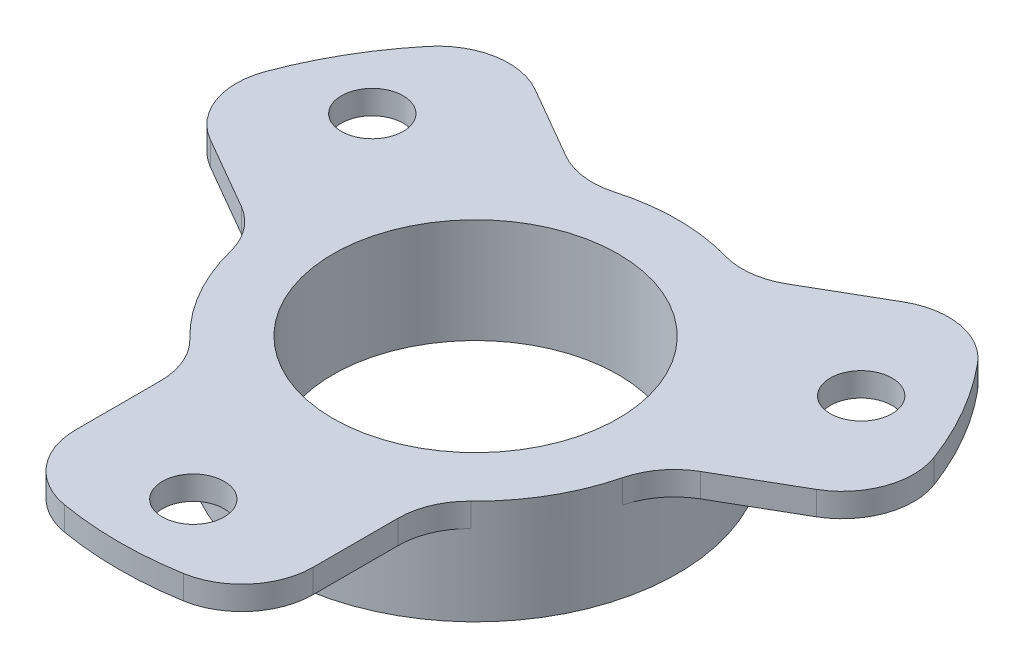
ISO-10303-21;
HEADER;
FILE_DESCRIPTION(('STEP AP214'),'2;1');
FILE_NAME('part.step','',(''),(''),'','','');
FILE_SCHEMA(('AUTOMOTIVE_DESIGN { 1 0 10303 214 1 1 1 1 }'));
ENDSEC;
DATA;
#1=APPLICATION_CONTEXT('core data for automotive mechanical design processes');
#2=APPLICATION_PROTOCOL_DEFINITION('international standard','automotive_design',2000,#1);
#3=PRODUCT_CONTEXT('',#1,'mechanical');
#4=PRODUCT('Part','Part','',(#3));
#5=PRODUCT_RELATED_PRODUCT_CATEGORY('part','',(#4));
#6=PRODUCT_DEFINITION_FORMATION('','',#4);
#7=PRODUCT_DEFINITION_CONTEXT('part definition',#1,'design');
#8=PRODUCT_DEFINITION('design','',#6,#7);
#9=PRODUCT_DEFINITION_SHAPE('','',#8);
#10=(LENGTH_UNIT() NAMED_UNIT(*) SI_UNIT(.MILLI.,.METRE.));
#11=(NAMED_UNIT(*) PLANE_ANGLE_UNIT() SI_UNIT($,.RADIAN.));
#12=(NAMED_UNIT(*) SI_UNIT($,.STERADIAN.) SOLID_ANGLE_UNIT());
#13=UNCERTAINTY_MEASURE_WITH_UNIT(LENGTH_MEASURE(1.E-05),#10,'distance_accuracy_value','');
#14=(GEOMETRIC_REPRESENTATION_CONTEXT(3) GLOBAL_UNCERTAINTY_ASSIGNED_CONTEXT((#13)) GLOBAL_UNIT_ASSIGNED_CONTEXT((#10,
#11,#12)) REPRESENTATION_CONTEXT('',''));
#15=CARTESIAN_POINT('',(0.,0.,0.));
#16=DIRECTION('',(0.,0.,1.));
#17=DIRECTION('',(1.,0.,0.));
#18=AXIS2_PLACEMENT_3D('',#15,#16,#17);
#19=CARTESIAN_POINT('',(-40.,2.,0.));
#20=DIRECTION('',(0.,1.,0.));
#21=DIRECTION('',(0.,0.,1.));
#22=AXIS2_PLACEMENT_3D('',#19,#20,#21);
#23=PLANE('',#22);
#24=CARTESIAN_POINT('',(0.,2.,23.75));
#25=DIRECTION('',(0.,-1.,0.));
#26=DIRECTION('',(0.,0.,-1.));
#27=AXIS2_PLACEMENT_3D('',#24,#25,#26);
#28=CIRCLE('',#27,2.6);
#29=CARTESIAN_POINT('',(0.,2.,21.15));
#30=VERTEX_POINT('',#29);
#31=EDGE_CURVE('E449',#30,#30,#28,.T.);
#32=ORIENTED_EDGE('',*,*,#31,.T.);
#33=EDGE_LOOP('',(#32));
#34=FACE_BOUND('',#33,.T.);
#35=CARTESIAN_POINT('',(0.,2.,0.));
#36=DIRECTION('',(0.,1.,0.));
#37=DIRECTION('',(0.,0.,1.));
#38=AXIS2_PLACEMENT_3D('',#35,#36,#37);
#39=CIRCLE('',#38,30.);
#40=CARTESIAN_POINT('',(-5.,2.,29.5803989154981));
#41=VERTEX_POINT('',#40);
#42=CARTESIAN_POINT('',(4.99999999999999,2.,29.5803989154981));
#43=VERTEX_POINT('',#42);
#44=EDGE_CURVE('E44',#41,#43,#39,.T.);
#45=ORIENTED_EDGE('',*,*,#44,.T.);
#46=CARTESIAN_POINT('',(4.,2.,23.6643191323985));
#47=DIRECTION('',(0.,1.,0.));
#48=DIRECTION('',(0.,0.,1.));
#49=AXIS2_PLACEMENT_3D('',#46,#47,#48);
#50=CIRCLE('',#49,6.);
#51=CARTESIAN_POINT('',(10.,2.,23.6643191323985));
#52=VERTEX_POINT('',#51);
#53=EDGE_CURVE('E12',#43,#52,#50,.T.);
#54=ORIENTED_EDGE('',*,*,#53,.T.);
#55=DIRECTION('',(0.,0.,-1.));
#56=VECTOR('',#55,1.);
#57=CARTESIAN_POINT('',(9.99999999999999,2.,0.));
#58=LINE('',#57,#56);
#59=CARTESIAN_POINT('',(9.99999999999999,2.,16.5227116418583));
#60=VERTEX_POINT('',#59);
#61=EDGE_CURVE('E298',#52,#60,#58,.T.);
#62=ORIENTED_EDGE('',*,*,#61,.T.);
#63=CARTESIAN_POINT('',(16.,2.,16.5227116418583));
#64=DIRECTION('',(0.,1.,0.));
#65=DIRECTION('',(0.,0.,1.));
#66=AXIS2_PLACEMENT_3D('',#63,#64,#65);
#67=CIRCLE('',#66,6.);
#68=CARTESIAN_POINT('',(11.8260869565217,2.,12.2124390396344));
#69=VERTEX_POINT('',#68);
#70=EDGE_CURVE('E207',#60,#69,#67,.F.);
#71=ORIENTED_EDGE('',*,*,#70,.T.);
#72=CARTESIAN_POINT('',(0.,2.,0.));
#73=DIRECTION('',(0.,1.,0.));
#74=DIRECTION('',(0.,0.,1.));
#75=AXIS2_PLACEMENT_3D('',#72,#73,#74);
#76=CIRCLE('',#75,17.);
#77=CARTESIAN_POINT('',(16.4893259287531,2.,4.13547221189442));
#78=VERTEX_POINT('',#77);
#79=EDGE_CURVE('E301',#69,#78,#76,.T.);
#80=ORIENTED_EDGE('',*,*,#79,.T.);
#81=CARTESIAN_POINT('',(22.3090880212542,2.,5.59505063962186));
#82=DIRECTION('',(0.,1.,0.));
#83=DIRECTION('',(0.,0.,1.));
#84=AXIS2_PLACEMENT_3D('',#81,#82,#83);
#85=CIRCLE('',#84,6.);
#86=CARTESIAN_POINT('',(19.3090880212542,2.,0.39889821691523));
#87=VERTEX_POINT('',#86);
#88=EDGE_CURVE('E304',#78,#87,#85,.F.);
#89=ORIENTED_EDGE('',*,*,#88,.T.);
#90=DIRECTION('',(0.866025403784439,0.,-0.5));
#91=VECTOR('',#90,1.);
#92=CARTESIAN_POINT('',(-25.,2.,25.9807621135332));
#93=LINE('',#92,#91);
#94=CARTESIAN_POINT('',(25.4939015319192,2.,-3.17190552835484));
#95=VERTEX_POINT('',#94);
#96=EDGE_CURVE('E307',#87,#95,#93,.T.);
#97=ORIENTED_EDGE('',*,*,#96,.T.);
#98=CARTESIAN_POINT('',(22.4939015319192,2.,-8.36805795106148));
#99=DIRECTION('',(0.,1.,0.));
#100=DIRECTION('',(0.,0.,1.));
#101=AXIS2_PLACEMENT_3D('',#98,#99,#100);
#102=CIRCLE('',#101,6.);
#103=CARTESIAN_POINT('',(28.117376914899,2.,-10.4600724388268));
#104=VERTEX_POINT('',#103);
#105=EDGE_CURVE('E310',#95,#104,#102,.T.);
#106=ORIENTED_EDGE('',*,*,#105,.T.);
#107=CARTESIAN_POINT('',(0.,2.,0.));
#108=DIRECTION('',(0.,1.,0.));
#109=DIRECTION('',(0.,0.,1.));
#110=AXIS2_PLACEMENT_3D('',#107,#108,#109);
#111=CIRCLE('',#110,30.);
#112=CARTESIAN_POINT('',(23.117376914899,2.,-19.1203264766712));
#113=VERTEX_POINT('',#112);
#114=EDGE_CURVE('E313',#104,#113,#111,.T.);
#115=ORIENTED_EDGE('',*,*,#114,.T.);
#116=CARTESIAN_POINT('',(18.4939015319192,2.,-15.296261181337));
#117=DIRECTION('',(0.,1.,0.));
#118=DIRECTION('',(0.,0.,1.));
#119=AXIS2_PLACEMENT_3D('',#116,#117,#118);
#120=CIRCLE('',#119,6.00000000000001);
#121=CARTESIAN_POINT('',(15.4939015319192,2.,-20.4924136040436));
#122=VERTEX_POINT('',#121);
#123=EDGE_CURVE('E316',#113,#122,#120,.T.);
#124=ORIENTED_EDGE('',*,*,#123,.T.);
#125=DIRECTION('',(-0.866025403784439,0.,0.5));
#126=VECTOR('',#125,1.);
#127=CARTESIAN_POINT('',(-35.,2.,8.66025403784439));
#128=LINE('',#127,#126);
#129=CARTESIAN_POINT('',(9.30908802125418,2.,-16.9216098587735));
#130=VERTEX_POINT('',#129);
#131=EDGE_CURVE('E319',#122,#130,#128,.T.);
#132=ORIENTED_EDGE('',*,*,#131,.T.);
#133=CARTESIAN_POINT('',(6.30908802125418,2.,-22.1177622814802));
#134=DIRECTION('',(0.,1.,0.));
#135=DIRECTION('',(0.,0.,1.));
#136=AXIS2_PLACEMENT_3D('',#133,#134,#135);
#137=CIRCLE('',#136,6.);
#138=CARTESIAN_POINT('',(4.66323897223135,2.,-16.3479112515288));
#139=VERTEX_POINT('',#138);
#140=EDGE_CURVE('E322',#130,#139,#137,.F.);
#141=ORIENTED_EDGE('',*,*,#140,.T.);
#142=CARTESIAN_POINT('',(0.,2.,0.));
#143=DIRECTION('',(0.,1.,0.));
#144=DIRECTION('',(0.,0.,1.));
#145=AXIS2_PLACEMENT_3D('',#142,#143,#144);
#146=CIRCLE('',#145,17.);
#147=CARTESIAN_POINT('',(-4.66323897223135,2.,-16.3479112515288));
#148=VERTEX_POINT('',#147);
#149=EDGE_CURVE('E325',#139,#148,#146,.T.);
#150=ORIENTED_EDGE('',*,*,#149,.T.);
#151=CARTESIAN_POINT('',(-6.30908802125418,2.,-22.1177622814802));
#152=DIRECTION('',(0.,1.,0.));
#153=DIRECTION('',(0.,0.,1.));
#154=AXIS2_PLACEMENT_3D('',#151,#152,#153);
#155=CIRCLE('',#154,6.);
#156=CARTESIAN_POINT('',(-9.30908802125419,2.,-16.9216098587735));
#157=VERTEX_POINT('',#156);
#158=EDGE_CURVE('E328',#148,#157,#155,.F.);
#159=ORIENTED_EDGE('',*,*,#158,.T.);
#160=DIRECTION('',(-0.866025403784439,0.,-0.5));
#161=VECTOR('',#160,1.);
#162=CARTESIAN_POINT('',(-25.,2.,-25.9807621135332));
#163=LINE('',#162,#161);
#164=CARTESIAN_POINT('',(-15.4939015319192,2.,-20.4924136040436));
#165=VERTEX_POINT('',#164);
#166=EDGE_CURVE('E331',#157,#165,#163,.T.);
#167=ORIENTED_EDGE('',*,*,#166,.T.);
#168=CARTESIAN_POINT('',(-18.4939015319192,2.,-15.296261181337));
#169=DIRECTION('',(0.,1.,0.));
#170=DIRECTION('',(0.,0.,1.));
#171=AXIS2_PLACEMENT_3D('',#168,#169,#170);
#172=CIRCLE('',#171,6.);
#173=CARTESIAN_POINT('',(-23.117376914899,2.,-19.1203264766712));
#174=VERTEX_POINT('',#173);
#175=EDGE_CURVE('E334',#165,#174,#172,.T.);
#176=ORIENTED_EDGE('',*,*,#175,.T.);
#177=CARTESIAN_POINT('',(0.,2.,0.));
#178=DIRECTION('',(0.,1.,0.));
#179=DIRECTION('',(0.,0.,1.));
#180=AXIS2_PLACEMENT_3D('',#177,#178,#179);
#181=CIRCLE('',#180,30.);
#182=CARTESIAN_POINT('',(-28.117376914899,2.,-10.4600724388268));
#183=VERTEX_POINT('',#182);
#184=EDGE_CURVE('E337',#174,#183,#181,.T.);
#185=ORIENTED_EDGE('',*,*,#184,.T.);
#186=CARTESIAN_POINT('',(-22.4939015319192,2.,-8.36805795106148));
#187=DIRECTION('',(0.,1.,0.));
#188=DIRECTION('',(0.,0.,1.));
#189=AXIS2_PLACEMENT_3D('',#186,#187,#188);
#190=CIRCLE('',#189,6.);
#191=CARTESIAN_POINT('',(-25.4939015319192,2.,-3.17190552835484));
#192=VERTEX_POINT('',#191);
#193=EDGE_CURVE('E340',#183,#192,#190,.T.);
#194=ORIENTED_EDGE('',*,*,#193,.T.);
#195=DIRECTION('',(0.866025403784439,0.,0.5));
#196=VECTOR('',#195,1.);
#197=CARTESIAN_POINT('',(-35.,2.,-8.66025403784439));
#198=LINE('',#197,#196);
#199=CARTESIAN_POINT('',(-19.3090880212542,2.,0.398898216915236));
#200=VERTEX_POINT('',#199);
#201=EDGE_CURVE('E343',#192,#200,#198,.T.);
#202=ORIENTED_EDGE('',*,*,#201,.T.);
#203=CARTESIAN_POINT('',(-22.3090880212542,2.,5.59505063962187));
#204=DIRECTION('',(0.,1.,0.));
#205=DIRECTION('',(0.,0.,1.));
#206=AXIS2_PLACEMENT_3D('',#203,#204,#205);
#207=CIRCLE('',#206,6.);
#208=CARTESIAN_POINT('',(-16.4893259287531,2.,4.13547221189442));
#209=VERTEX_POINT('',#208);
#210=EDGE_CURVE('E346',#200,#209,#207,.F.);
#211=ORIENTED_EDGE('',*,*,#210,.T.);
#212=CARTESIAN_POINT('',(0.,2.,0.));
#213=DIRECTION('',(0.,1.,0.));
#214=DIRECTION('',(0.,0.,1.));
#215=AXIS2_PLACEMENT_3D('',#212,#213,#214);
#216=CIRCLE('',#215,17.);
#217=CARTESIAN_POINT('',(-11.8260869565217,2.,12.2124390396344));
#218=VERTEX_POINT('',#217);
#219=EDGE_CURVE('E349',#209,#218,#216,.T.);
#220=ORIENTED_EDGE('',*,*,#219,.T.);
#221=CARTESIAN_POINT('',(-16.,2.,16.5227116418583));
#222=DIRECTION('',(0.,1.,0.));
#223=DIRECTION('',(0.,0.,1.));
#224=AXIS2_PLACEMENT_3D('',#221,#222,#223);
#225=CIRCLE('',#224,6.);
#226=CARTESIAN_POINT('',(-9.99999999999999,2.,16.5227116418583));
#227=VERTEX_POINT('',#226);
#228=EDGE_CURVE('E352',#218,#227,#225,.F.);
#229=ORIENTED_EDGE('',*,*,#228,.T.);
#230=DIRECTION('',(0.,0.,1.));
#231=VECTOR('',#230,1.);
#232=CARTESIAN_POINT('',(-9.99999999999999,2.,0.));
#233=LINE('',#232,#231);
#234=CARTESIAN_POINT('',(-10.,2.,23.6643191323985));
#235=VERTEX_POINT('',#234);
#236=EDGE_CURVE('E355',#227,#235,#233,.T.);
#237=ORIENTED_EDGE('',*,*,#236,.T.);
#238=CARTESIAN_POINT('',(-4.,2.,23.6643191323985));
#239=DIRECTION('',(0.,1.,0.));
#240=DIRECTION('',(0.,0.,1.));
#241=AXIS2_PLACEMENT_3D('',#238,#239,#240);
#242=CIRCLE('',#241,6.);
#243=EDGE_CURVE('E358',#235,#41,#242,.T.);
#244=ORIENTED_EDGE('',*,*,#243,.T.);
#245=EDGE_LOOP('',(#45,#54,#62,#71,#80,#89,#97,#106,#115,#124,#132,#141,#150,#159,#167,#176,
#185,#194,#202,#211,#220,#229,#237,#244));
#246=FACE_BOUND('',#245,.T.);
#247=CARTESIAN_POINT('',(0.,2.,0.));
#248=DIRECTION('',(0.,1.,0.));
#249=DIRECTION('',(0.,0.,1.));
#250=AXIS2_PLACEMENT_3D('',#247,#248,#249);
#251=CIRCLE('',#250,12.);
#252=CARTESIAN_POINT('',(0.,2.,12.));
#253=VERTEX_POINT('',#252);
#254=EDGE_CURVE('E274',#253,#253,#251,.T.);
#255=ORIENTED_EDGE('',*,*,#254,.F.);
#256=EDGE_LOOP('',(#255));
#257=FACE_BOUND('',#256,.T.);
#258=CARTESIAN_POINT('',(20.5681033398804,2.,-11.875));
#259=DIRECTION('',(0.,-1.,0.));
#260=DIRECTION('',(0.,0.,-1.));
#261=AXIS2_PLACEMENT_3D('',#258,#259,#260);
#262=CIRCLE('',#261,2.6);
#263=CARTESIAN_POINT('',(20.5681033398804,2.,-14.475));
#264=VERTEX_POINT('',#263);
#265=EDGE_CURVE('E434',#264,#264,#262,.T.);
#266=ORIENTED_EDGE('',*,*,#265,.T.);
#267=EDGE_LOOP('',(#266));
#268=FACE_BOUND('',#267,.T.);
#269=CARTESIAN_POINT('',(-20.5681033398805,2.,-11.8749999999999));
#270=DIRECTION('',(0.,-1.,0.));
#271=DIRECTION('',(0.,0.,-1.));
#272=AXIS2_PLACEMENT_3D('',#269,#270,#271);
#273=CIRCLE('',#272,2.6);
#274=CARTESIAN_POINT('',(-20.5681033398805,2.,-14.4749999999999));
#275=VERTEX_POINT('',#274);
#276=EDGE_CURVE('E441',#275,#275,#273,.T.);
#277=ORIENTED_EDGE('',*,*,#276,.T.);
#278=EDGE_LOOP('',(#277));
#279=FACE_BOUND('',#278,.T.);
#280=ADVANCED_FACE('F36',(#34,#246,#257,#268,#279),#23,.T.);
#281=CARTESIAN_POINT('',(-40.,0.,0.));
#282=DIRECTION('',(0.,-1.,0.));
#283=DIRECTION('',(0.,0.,-1.));
#284=AXIS2_PLACEMENT_3D('',#281,#282,#283);
#285=PLANE('',#284);
#286=CARTESIAN_POINT('',(-20.5681033398805,0.,-11.8749999999999));
#287=DIRECTION('',(0.,-1.,0.));
#288=DIRECTION('',(0.,0.,-1.));
#289=AXIS2_PLACEMENT_3D('',#286,#287,#288);
#290=CIRCLE('',#289,2.6);
#291=CARTESIAN_POINT('',(-20.5681033398805,0.,-14.4749999999999));
#292=VERTEX_POINT('',#291);
#293=EDGE_CURVE('E446',#292,#292,#290,.T.);
#294=ORIENTED_EDGE('',*,*,#293,.F.);
#295=EDGE_LOOP('',(#294));
#296=FACE_BOUND('',#295,.T.);
#297=CARTESIAN_POINT('',(0.,0.,0.));
#298=DIRECTION('',(0.,1.,0.));
#299=DIRECTION('',(0.,0.,1.));
#300=AXIS2_PLACEMENT_3D('',#297,#298,#299);
#301=CIRCLE('',#300,17.);
#302=CARTESIAN_POINT('',(-4.66323897223135,0.,-16.3479112515288));
#303=VERTEX_POINT('',#302);
#304=CARTESIAN_POINT('',(-16.4893259287531,0.,4.13547221189442));
#305=VERTEX_POINT('',#304);
#306=EDGE_CURVE('E296',#303,#305,#301,.T.);
#307=ORIENTED_EDGE('',*,*,#306,.T.);
#308=CARTESIAN_POINT('',(-22.3090880212542,0.,5.59505063962187));
#309=DIRECTION('',(0.,-1.,0.));
#310=DIRECTION('',(0.,0.,-1.));
#311=AXIS2_PLACEMENT_3D('',#308,#309,#310);
#312=CIRCLE('',#311,6.);
#313=CARTESIAN_POINT('',(-19.3090880212542,0.,0.398898216915236));
#314=VERTEX_POINT('',#313);
#315=EDGE_CURVE('E259',#305,#314,#312,.F.);
#316=ORIENTED_EDGE('',*,*,#315,.T.);
#317=DIRECTION('',(-0.866025403784439,0.,-0.5));
#318=VECTOR('',#317,1.);
#319=CARTESIAN_POINT('',(-35.,0.,-8.66025403784439));
#320=LINE('',#319,#318);
#321=CARTESIAN_POINT('',(-25.4939015319192,0.,-3.17190552835484));
#322=VERTEX_POINT('',#321);
#323=EDGE_CURVE('E256',#314,#322,#320,.T.);
#324=ORIENTED_EDGE('',*,*,#323,.T.);
#325=CARTESIAN_POINT('',(-22.4939015319192,0.,-8.36805795106148));
#326=DIRECTION('',(0.,-1.,0.));
#327=DIRECTION('',(0.,0.,-1.));
#328=AXIS2_PLACEMENT_3D('',#325,#326,#327);
#329=CIRCLE('',#328,6.);
#330=CARTESIAN_POINT('',(-28.117376914899,0.,-10.4600724388268));
#331=VERTEX_POINT('',#330);
#332=EDGE_CURVE('E253',#322,#331,#329,.T.);
#333=ORIENTED_EDGE('',*,*,#332,.T.);
#334=CARTESIAN_POINT('',(0.,0.,0.));
#335=DIRECTION('',(0.,-1.,0.));
#336=DIRECTION('',(0.,0.,-1.));
#337=AXIS2_PLACEMENT_3D('',#334,#335,#336);
#338=CIRCLE('',#337,30.);
#339=CARTESIAN_POINT('',(-23.117376914899,0.,-19.1203264766712));
#340=VERTEX_POINT('',#339);
#341=EDGE_CURVE('E250',#331,#340,#338,.T.);
#342=ORIENTED_EDGE('',*,*,#341,.T.);
#343=CARTESIAN_POINT('',(-18.4939015319192,0.,-15.296261181337));
#344=DIRECTION('',(0.,-1.,0.));
#345=DIRECTION('',(0.,0.,-1.));
#346=AXIS2_PLACEMENT_3D('',#343,#344,#345);
#347=CIRCLE('',#346,6.);
#348=CARTESIAN_POINT('',(-15.4939015319192,0.,-20.4924136040436));
#349=VERTEX_POINT('',#348);
#350=EDGE_CURVE('E247',#340,#349,#347,.T.);
#351=ORIENTED_EDGE('',*,*,#350,.T.);
#352=DIRECTION('',(0.866025403784439,0.,0.5));
#353=VECTOR('',#352,1.);
#354=CARTESIAN_POINT('',(-25.,0.,-25.9807621135332));
#355=LINE('',#354,#353);
#356=CARTESIAN_POINT('',(-9.30908802125419,0.,-16.9216098587735));
#357=VERTEX_POINT('',#356);
#358=EDGE_CURVE('E244',#349,#357,#355,.T.);
#359=ORIENTED_EDGE('',*,*,#358,.T.);
#360=CARTESIAN_POINT('',(-6.30908802125418,0.,-22.1177622814802));
#361=DIRECTION('',(0.,-1.,0.));
#362=DIRECTION('',(0.,0.,-1.));
#363=AXIS2_PLACEMENT_3D('',#360,#361,#362);
#364=CIRCLE('',#363,6.);
#365=EDGE_CURVE('E241',#357,#303,#364,.F.);
#366=ORIENTED_EDGE('',*,*,#365,.T.);
#367=EDGE_LOOP('',(#307,#316,#324,#333,#342,#351,#359,#366));
#368=FACE_BOUND('',#367,.T.);
#369=ADVANCED_FACE('F38',(#296,#368),#285,.T.);
#370=CARTESIAN_POINT('',(20.5681033398804,0.,-11.875));
#371=DIRECTION('',(0.,-1.,0.));
#372=DIRECTION('',(0.,0.,-1.));
#373=AXIS2_PLACEMENT_3D('',#370,#371,#372);
#374=CIRCLE('',#373,2.6);
#375=CARTESIAN_POINT('',(20.5681033398804,0.,-14.475));
#376=VERTEX_POINT('',#375);
#377=EDGE_CURVE('E437',#376,#376,#374,.T.);
#378=ORIENTED_EDGE('',*,*,#377,.F.);
#379=EDGE_LOOP('',(#378));
#380=FACE_BOUND('',#379,.T.);
#381=CARTESIAN_POINT('',(16.4893259287531,0.,4.13547221189442));
#382=VERTEX_POINT('',#381);
#383=CARTESIAN_POINT('',(4.66323897223135,0.,-16.3479112515288));
#384=VERTEX_POINT('',#383);
#385=EDGE_CURVE('E297',#382,#384,#301,.T.);
#386=ORIENTED_EDGE('',*,*,#385,.T.);
#387=CARTESIAN_POINT('',(6.30908802125418,0.,-22.1177622814802));
#388=DIRECTION('',(0.,-1.,0.));
#389=DIRECTION('',(0.,0.,-1.));
#390=AXIS2_PLACEMENT_3D('',#387,#388,#389);
#391=CIRCLE('',#390,6.);
#392=CARTESIAN_POINT('',(9.30908802125418,0.,-16.9216098587735));
#393=VERTEX_POINT('',#392);
#394=EDGE_CURVE('E238',#384,#393,#391,.F.);
#395=ORIENTED_EDGE('',*,*,#394,.T.);
#396=DIRECTION('',(0.866025403784439,0.,-0.5));
#397=VECTOR('',#396,1.);
#398=CARTESIAN_POINT('',(-35.,0.,8.66025403784439));
#399=LINE('',#398,#397);
#400=CARTESIAN_POINT('',(15.4939015319192,0.,-20.4924136040436));
#401=VERTEX_POINT('',#400);
#402=EDGE_CURVE('E235',#393,#401,#399,.T.);
#403=ORIENTED_EDGE('',*,*,#402,.T.);
#404=CARTESIAN_POINT('',(18.4939015319192,0.,-15.296261181337));
#405=DIRECTION('',(0.,-1.,0.));
#406=DIRECTION('',(0.,0.,-1.));
#407=AXIS2_PLACEMENT_3D('',#404,#405,#406);
#408=CIRCLE('',#407,6.00000000000001);
#409=CARTESIAN_POINT('',(23.117376914899,0.,-19.1203264766712));
#410=VERTEX_POINT('',#409);
#411=EDGE_CURVE('E232',#401,#410,#408,.T.);
#412=ORIENTED_EDGE('',*,*,#411,.T.);
#413=CARTESIAN_POINT('',(0.,0.,0.));
#414=DIRECTION('',(0.,-1.,0.));
#415=DIRECTION('',(0.,0.,-1.));
#416=AXIS2_PLACEMENT_3D('',#413,#414,#415);
#417=CIRCLE('',#416,30.);
#418=CARTESIAN_POINT('',(28.117376914899,0.,-10.4600724388268));
#419=VERTEX_POINT('',#418);
#420=EDGE_CURVE('E229',#410,#419,#417,.T.);
#421=ORIENTED_EDGE('',*,*,#420,.T.);
#422=CARTESIAN_POINT('',(22.4939015319192,0.,-8.36805795106148));
#423=DIRECTION('',(0.,-1.,0.));
#424=DIRECTION('',(0.,0.,-1.));
#425=AXIS2_PLACEMENT_3D('',#422,#423,#424);
#426=CIRCLE('',#425,6.);
#427=CARTESIAN_POINT('',(25.4939015319192,0.,-3.17190552835484));
#428=VERTEX_POINT('',#427);
#429=EDGE_CURVE('E226',#419,#428,#426,.T.);
#430=ORIENTED_EDGE('',*,*,#429,.T.);
#431=DIRECTION('',(-0.866025403784439,0.,0.5));
#432=VECTOR('',#431,1.);
#433=CARTESIAN_POINT('',(-25.,0.,25.9807621135332));
#434=LINE('',#433,#432);
#435=CARTESIAN_POINT('',(19.3090880212542,0.,0.39889821691523));
#436=VERTEX_POINT('',#435);
#437=EDGE_CURVE('E220',#428,#436,#434,.T.);
#438=ORIENTED_EDGE('',*,*,#437,.T.);
#439=CARTESIAN_POINT('',(22.3090880212542,0.,5.59505063962186));
#440=DIRECTION('',(0.,-1.,0.));
#441=DIRECTION('',(0.,0.,-1.));
#442=AXIS2_PLACEMENT_3D('',#439,#440,#441);
#443=CIRCLE('',#442,6.);
#444=EDGE_CURVE('E217',#436,#382,#443,.F.);
#445=ORIENTED_EDGE('',*,*,#444,.T.);
#446=EDGE_LOOP('',(#386,#395,#403,#412,#421,#430,#438,#445));
#447=FACE_BOUND('',#446,.T.);
#448=ADVANCED_FACE('F460',(#380,#447),#285,.T.);
#449=CARTESIAN_POINT('',(0.,0.,23.75));
#450=DIRECTION('',(0.,-1.,0.));
#451=DIRECTION('',(0.,0.,-1.));
#452=AXIS2_PLACEMENT_3D('',#449,#450,#451);
#453=CIRCLE('',#452,2.6);
#454=CARTESIAN_POINT('',(0.,0.,21.15));
#455=VERTEX_POINT('',#454);
#456=EDGE_CURVE('E452',#455,#455,#453,.T.);
#457=ORIENTED_EDGE('',*,*,#456,.F.);
#458=EDGE_LOOP('',(#457));
#459=FACE_BOUND('',#458,.T.);
#460=DIRECTION('',(0.,0.,-1.));
#461=VECTOR('',#460,1.);
#462=CARTESIAN_POINT('',(-9.99999999999999,0.,0.));
#463=LINE('',#462,#461);
#464=CARTESIAN_POINT('',(-10.,0.,23.6643191323985));
#465=VERTEX_POINT('',#464);
#466=CARTESIAN_POINT('',(-9.99999999999999,0.,16.5227116418583));
#467=VERTEX_POINT('',#466);
#468=EDGE_CURVE('E264',#465,#467,#463,.T.);
#469=ORIENTED_EDGE('',*,*,#468,.T.);
#470=CARTESIAN_POINT('',(-16.,0.,16.5227116418583));
#471=DIRECTION('',(0.,-1.,0.));
#472=DIRECTION('',(0.,0.,-1.));
#473=AXIS2_PLACEMENT_3D('',#470,#471,#472);
#474=CIRCLE('',#473,6.);
#475=CARTESIAN_POINT('',(-11.8260869565217,0.,12.2124390396344));
#476=VERTEX_POINT('',#475);
#477=EDGE_CURVE('E262',#467,#476,#474,.F.);
#478=ORIENTED_EDGE('',*,*,#477,.T.);
#479=CARTESIAN_POINT('',(11.8260869565217,0.,12.2124390396344));
#480=VERTEX_POINT('',#479);
#481=EDGE_CURVE('E216',#476,#480,#301,.T.);
#482=ORIENTED_EDGE('',*,*,#481,.T.);
#483=CARTESIAN_POINT('',(16.,0.,16.5227116418583));
#484=DIRECTION('',(0.,-1.,0.));
#485=DIRECTION('',(0.,0.,-1.));
#486=AXIS2_PLACEMENT_3D('',#483,#484,#485);
#487=CIRCLE('',#486,6.);
#488=CARTESIAN_POINT('',(10.,0.,16.5227116418583));
#489=VERTEX_POINT('',#488);
#490=EDGE_CURVE('E199',#480,#489,#487,.F.);
#491=ORIENTED_EDGE('',*,*,#490,.T.);
#492=DIRECTION('',(0.,0.,1.));
#493=VECTOR('',#492,1.);
#494=CARTESIAN_POINT('',(9.99999999999999,0.,0.));
#495=LINE('',#494,#493);
#496=CARTESIAN_POINT('',(9.99999999999999,0.,23.6643191323985));
#497=VERTEX_POINT('',#496);
#498=EDGE_CURVE('E194',#489,#497,#495,.T.);
#499=ORIENTED_EDGE('',*,*,#498,.T.);
#500=CARTESIAN_POINT('',(4.,0.,23.6643191323985));
#501=DIRECTION('',(0.,-1.,0.));
#502=DIRECTION('',(0.,0.,-1.));
#503=AXIS2_PLACEMENT_3D('',#500,#501,#502);
#504=CIRCLE('',#503,6.);
#505=CARTESIAN_POINT('',(4.99999999999999,0.,29.5803989154981));
#506=VERTEX_POINT('',#505);
#507=EDGE_CURVE('E272',#497,#506,#504,.T.);
#508=ORIENTED_EDGE('',*,*,#507,.T.);
#509=CARTESIAN_POINT('',(0.,0.,0.));
#510=DIRECTION('',(0.,-1.,0.));
#511=DIRECTION('',(0.,0.,-1.));
#512=AXIS2_PLACEMENT_3D('',#509,#510,#511);
#513=CIRCLE('',#512,30.);
#514=CARTESIAN_POINT('',(-5.,0.,29.5803989154981));
#515=VERTEX_POINT('',#514);
#516=EDGE_CURVE('E269',#506,#515,#513,.T.);
#517=ORIENTED_EDGE('',*,*,#516,.T.);
#518=CARTESIAN_POINT('',(-4.,0.,23.6643191323985));
#519=DIRECTION('',(0.,-1.,0.));
#520=DIRECTION('',(0.,0.,-1.));
#521=AXIS2_PLACEMENT_3D('',#518,#519,#520);
#522=CIRCLE('',#521,6.);
#523=EDGE_CURVE('E266',#515,#465,#522,.T.);
#524=ORIENTED_EDGE('',*,*,#523,.T.);
#525=EDGE_LOOP('',(#469,#478,#482,#491,#499,#508,#517,#524));
#526=FACE_BOUND('',#525,.T.);
#527=ADVANCED_FACE('F213',(#459,#526),#285,.T.);
#528=CARTESIAN_POINT('',(0.,30.0771468736568,0.));
#529=DIRECTION('',(0.,1.,0.));
#530=DIRECTION('',(0.,0.,1.));
#531=AXIS2_PLACEMENT_3D('',#528,#529,#530);
#532=CYLINDRICAL_SURFACE('',#531,17.);
#533=ORIENTED_EDGE('',*,*,#481,.F.);
#534=DIRECTION('',(0.,1.,0.));
#535=VECTOR('',#534,1.);
#536=CARTESIAN_POINT('',(-11.8260869565217,-15.,12.2124390396344));
#537=LINE('',#536,#535);
#538=EDGE_CURVE('E383',#476,#218,#537,.T.);
#539=ORIENTED_EDGE('',*,*,#538,.T.);
#540=ORIENTED_EDGE('',*,*,#219,.F.);
#541=DIRECTION('',(0.,1.,0.));
#542=VECTOR('',#541,1.);
#543=CARTESIAN_POINT('',(-16.4893259287531,-15.,4.13547221189442));
#544=LINE('',#543,#542);
#545=EDGE_CURVE('E386',#305,#209,#544,.T.);
#546=ORIENTED_EDGE('',*,*,#545,.F.);
#547=ORIENTED_EDGE('',*,*,#306,.F.);
#548=DIRECTION('',(0.,1.,0.));
#549=VECTOR('',#548,1.);
#550=CARTESIAN_POINT('',(-4.66323897223135,-15.,-16.3479112515288));
#551=LINE('',#550,#549);
#552=EDGE_CURVE('E407',#303,#148,#551,.T.);
#553=ORIENTED_EDGE('',*,*,#552,.T.);
#554=ORIENTED_EDGE('',*,*,#149,.F.);
#555=DIRECTION('',(0.,1.,0.));
#556=VECTOR('',#555,1.);
#557=CARTESIAN_POINT('',(4.66323897223135,-15.,-16.3479112515288));
#558=LINE('',#557,#556);
#559=EDGE_CURVE('E410',#384,#139,#558,.T.);
#560=ORIENTED_EDGE('',*,*,#559,.F.);
#561=ORIENTED_EDGE('',*,*,#385,.F.);
#562=DIRECTION('',(0.,1.,0.));
#563=VECTOR('',#562,1.);
#564=CARTESIAN_POINT('',(16.4893259287531,-15.,4.13547221189442));
#565=LINE('',#564,#563);
#566=EDGE_CURVE('E431',#382,#78,#565,.T.);
#567=ORIENTED_EDGE('',*,*,#566,.T.);
#568=ORIENTED_EDGE('',*,*,#79,.F.);
#569=DIRECTION('',(0.,1.,0.));
#570=VECTOR('',#569,1.);
#571=CARTESIAN_POINT('',(11.8260869565217,-15.,12.2124390396344));
#572=LINE('',#571,#570);
#573=EDGE_CURVE('E209',#480,#69,#572,.T.);
#574=ORIENTED_EDGE('',*,*,#573,.F.);
#575=EDGE_LOOP('',(#533,#539,#540,#546,#547,#553,#554,#560,#561,#567,#568,#574));
#576=FACE_BOUND('',#575,.T.);
#577=CARTESIAN_POINT('',(0.,-6.8,0.));
#578=DIRECTION('',(0.,1.,0.));
#579=DIRECTION('',(0.,0.,1.));
#580=AXIS2_PLACEMENT_3D('',#577,#578,#579);
#581=CIRCLE('',#580,17.);
#582=CARTESIAN_POINT('',(0.,-6.8,17.));
#583=VERTEX_POINT('',#582);
#584=EDGE_CURVE('E292',#583,#583,#581,.T.);
#585=ORIENTED_EDGE('',*,*,#584,.T.);
#586=EDGE_LOOP('',(#585));
#587=FACE_BOUND('',#586,.T.);
#588=ADVANCED_FACE('F459',(#576,#587),#532,.T.);
#589=CARTESIAN_POINT('',(-15.5,-6.8,0.));
#590=DIRECTION('',(0.,-1.,0.));
#591=DIRECTION('',(0.,0.,-1.));
#592=AXIS2_PLACEMENT_3D('',#589,#590,#591);
#593=PLANE('',#592);
#594=CARTESIAN_POINT('',(0.,-6.8,0.));
#595=DIRECTION('',(0.,1.,0.));
#596=DIRECTION('',(0.,0.,1.));
#597=AXIS2_PLACEMENT_3D('',#594,#595,#596);
#598=CIRCLE('',#597,15.5);
#599=CARTESIAN_POINT('',(0.,-6.8,15.5));
#600=VERTEX_POINT('',#599);
#601=EDGE_CURVE('E289',#600,#600,#598,.T.);
#602=ORIENTED_EDGE('',*,*,#601,.T.);
#603=EDGE_LOOP('',(#602));
#604=FACE_BOUND('',#603,.T.);
#605=ORIENTED_EDGE('',*,*,#584,.F.);
#606=EDGE_LOOP('',(#605));
#607=FACE_BOUND('',#606,.T.);
#608=ADVANCED_FACE('F465',(#604,#607),#593,.T.);
#609=CARTESIAN_POINT('',(0.,30.0771468736568,0.));
#610=DIRECTION('',(0.,1.,0.));
#611=DIRECTION('',(0.,0.,1.));
#612=AXIS2_PLACEMENT_3D('',#609,#610,#611);
#613=CYLINDRICAL_SURFACE('',#612,15.5);
#614=CARTESIAN_POINT('',(0.,0.,0.));
#615=DIRECTION('',(0.,1.,0.));
#616=DIRECTION('',(0.,0.,1.));
#617=AXIS2_PLACEMENT_3D('',#614,#615,#616);
#618=CIRCLE('',#617,15.5);
#619=CARTESIAN_POINT('',(0.,0.,15.5));
#620=VERTEX_POINT('',#619);
#621=EDGE_CURVE('E286',#620,#620,#618,.T.);
#622=ORIENTED_EDGE('',*,*,#621,.T.);
#623=EDGE_LOOP('',(#622));
#624=FACE_BOUND('',#623,.T.);
#625=ORIENTED_EDGE('',*,*,#601,.F.);
#626=EDGE_LOOP('',(#625));
#627=FACE_BOUND('',#626,.T.);
#628=ADVANCED_FACE('F494',(#624,#627),#613,.F.);
#629=CARTESIAN_POINT('',(-15.5,0.,0.));
#630=DIRECTION('',(0.,-1.,0.));
#631=DIRECTION('',(0.,0.,-1.));
#632=AXIS2_PLACEMENT_3D('',#629,#630,#631);
#633=PLANE('',#632);
#634=CARTESIAN_POINT('',(0.,0.,0.));
#635=DIRECTION('',(0.,1.,0.));
#636=DIRECTION('',(0.,0.,1.));
#637=AXIS2_PLACEMENT_3D('',#634,#635,#636);
#638=CIRCLE('',#637,13.5);
#639=CARTESIAN_POINT('',(0.,0.,13.5));
#640=VERTEX_POINT('',#639);
#641=EDGE_CURVE('E283',#640,#640,#638,.T.);
#642=ORIENTED_EDGE('',*,*,#641,.T.);
#643=EDGE_LOOP('',(#642));
#644=FACE_BOUND('',#643,.T.);
#645=ORIENTED_EDGE('',*,*,#621,.F.);
#646=EDGE_LOOP('',(#645));
#647=FACE_BOUND('',#646,.T.);
#648=ADVANCED_FACE('F490',(#644,#647),#633,.T.);
#649=CARTESIAN_POINT('',(0.,30.0771468736568,0.));
#650=DIRECTION('',(0.,1.,0.));
#651=DIRECTION('',(0.,0.,1.));
#652=AXIS2_PLACEMENT_3D('',#649,#650,#651);
#653=CYLINDRICAL_SURFACE('',#652,13.5);
#654=CARTESIAN_POINT('',(0.,-6.8,0.));
#655=DIRECTION('',(0.,1.,0.));
#656=DIRECTION('',(0.,0.,1.));
#657=AXIS2_PLACEMENT_3D('',#654,#655,#656);
#658=CIRCLE('',#657,13.5);
#659=CARTESIAN_POINT('',(0.,-6.8,13.5));
#660=VERTEX_POINT('',#659);
#661=EDGE_CURVE('E280',#660,#660,#658,.T.);
#662=ORIENTED_EDGE('',*,*,#661,.T.);
#663=EDGE_LOOP('',(#662));
#664=FACE_BOUND('',#663,.T.);
#665=ORIENTED_EDGE('',*,*,#641,.F.);
#666=EDGE_LOOP('',(#665));
#667=FACE_BOUND('',#666,.T.);
#668=ADVANCED_FACE('F486',(#664,#667),#653,.T.);
#669=CARTESIAN_POINT('',(-12.,-6.8,0.));
#670=DIRECTION('',(0.,-1.,0.));
#671=DIRECTION('',(0.,0.,-1.));
#672=AXIS2_PLACEMENT_3D('',#669,#670,#671);
#673=PLANE('',#672);
#674=CARTESIAN_POINT('',(0.,-6.8,0.));
#675=DIRECTION('',(0.,1.,0.));
#676=DIRECTION('',(0.,0.,1.));
#677=AXIS2_PLACEMENT_3D('',#674,#675,#676);
#678=CIRCLE('',#677,12.);
#679=CARTESIAN_POINT('',(0.,-6.8,12.));
#680=VERTEX_POINT('',#679);
#681=EDGE_CURVE('E277',#680,#680,#678,.T.);
#682=ORIENTED_EDGE('',*,*,#681,.T.);
#683=EDGE_LOOP('',(#682));
#684=FACE_BOUND('',#683,.T.);
#685=ORIENTED_EDGE('',*,*,#661,.F.);
#686=EDGE_LOOP('',(#685));
#687=FACE_BOUND('',#686,.T.);
#688=ADVANCED_FACE('F482',(#684,#687),#673,.T.);
#689=CARTESIAN_POINT('',(0.,30.0771468736568,0.));
#690=DIRECTION('',(0.,1.,0.));
#691=DIRECTION('',(0.,0.,1.));
#692=AXIS2_PLACEMENT_3D('',#689,#690,#691);
#693=CYLINDRICAL_SURFACE('',#692,12.);
#694=ORIENTED_EDGE('',*,*,#254,.T.);
#695=EDGE_LOOP('',(#694));
#696=FACE_BOUND('',#695,.T.);
#697=ORIENTED_EDGE('',*,*,#681,.F.);
#698=EDGE_LOOP('',(#697));
#699=FACE_BOUND('',#698,.T.);
#700=ADVANCED_FACE('F479',(#696,#699),#693,.F.);
#701=CARTESIAN_POINT('',(4.,-15.,23.6643191323985));
#702=DIRECTION('',(0.,1.,0.));
#703=DIRECTION('',(0.,0.,1.));
#704=AXIS2_PLACEMENT_3D('',#701,#702,#703);
#705=CYLINDRICAL_SURFACE('',#704,6.);
#706=DIRECTION('',(0.,1.,0.));
#707=VECTOR('',#706,1.);
#708=CARTESIAN_POINT('',(10.,-15.,23.6643191323985));
#709=LINE('',#708,#707);
#710=EDGE_CURVE('E51',#497,#52,#709,.T.);
#711=ORIENTED_EDGE('',*,*,#710,.T.);
#712=ORIENTED_EDGE('',*,*,#53,.F.);
#713=DIRECTION('',(0.,1.,0.));
#714=VECTOR('',#713,1.);
#715=CARTESIAN_POINT('',(4.99999999999999,-15.,29.5803989154981));
#716=LINE('',#715,#714);
#717=EDGE_CURVE('E200',#506,#43,#716,.T.);
#718=ORIENTED_EDGE('',*,*,#717,.F.);
#719=ORIENTED_EDGE('',*,*,#507,.F.);
#720=EDGE_LOOP('',(#711,#712,#718,#719));
#721=FACE_BOUND('',#720,.T.);
#722=ADVANCED_FACE('F477',(#721),#705,.T.);
#723=CARTESIAN_POINT('',(0.,-15.,0.));
#724=DIRECTION('',(0.,1.,0.));
#725=DIRECTION('',(0.,0.,1.));
#726=AXIS2_PLACEMENT_3D('',#723,#724,#725);
#727=CYLINDRICAL_SURFACE('',#726,30.);
#728=ORIENTED_EDGE('',*,*,#717,.T.);
#729=ORIENTED_EDGE('',*,*,#44,.F.);
#730=DIRECTION('',(0.,1.,0.));
#731=VECTOR('',#730,1.);
#732=CARTESIAN_POINT('',(-5.,-15.,29.5803989154981));
#733=LINE('',#732,#731);
#734=EDGE_CURVE('E368',#515,#41,#733,.T.);
#735=ORIENTED_EDGE('',*,*,#734,.F.);
#736=ORIENTED_EDGE('',*,*,#516,.F.);
#737=EDGE_LOOP('',(#728,#729,#735,#736));
#738=FACE_BOUND('',#737,.T.);
#739=ADVANCED_FACE('F367',(#738),#727,.T.);
#740=CARTESIAN_POINT('',(-4.,-15.,23.6643191323985));
#741=DIRECTION('',(0.,1.,0.));
#742=DIRECTION('',(0.,0.,1.));
#743=AXIS2_PLACEMENT_3D('',#740,#741,#742);
#744=CYLINDRICAL_SURFACE('',#743,6.);
#745=ORIENTED_EDGE('',*,*,#734,.T.);
#746=ORIENTED_EDGE('',*,*,#243,.F.);
#747=DIRECTION('',(0.,1.,0.));
#748=VECTOR('',#747,1.);
#749=CARTESIAN_POINT('',(-10.,-15.,23.6643191323985));
#750=LINE('',#749,#748);
#751=EDGE_CURVE('E374',#465,#235,#750,.T.);
#752=ORIENTED_EDGE('',*,*,#751,.F.);
#753=ORIENTED_EDGE('',*,*,#523,.F.);
#754=EDGE_LOOP('',(#745,#746,#752,#753));
#755=FACE_BOUND('',#754,.T.);
#756=ADVANCED_FACE('F371',(#755),#744,.T.);
#757=CARTESIAN_POINT('',(-10.,-15.,23.6643191323985));
#758=DIRECTION('',(-1.,0.,0.));
#759=DIRECTION('',(0.,0.,1.));
#760=AXIS2_PLACEMENT_3D('',#757,#758,#759);
#761=PLANE('',#760);
#762=ORIENTED_EDGE('',*,*,#751,.T.);
#763=ORIENTED_EDGE('',*,*,#236,.F.);
#764=DIRECTION('',(0.,1.,0.));
#765=VECTOR('',#764,1.);
#766=CARTESIAN_POINT('',(-9.99999999999999,-15.,16.5227116418583));
#767=LINE('',#766,#765);
#768=EDGE_CURVE('E377',#467,#227,#767,.T.);
#769=ORIENTED_EDGE('',*,*,#768,.F.);
#770=ORIENTED_EDGE('',*,*,#468,.F.);
#771=EDGE_LOOP('',(#762,#763,#769,#770));
#772=FACE_BOUND('',#771,.T.);
#773=ADVANCED_FACE('F547',(#772),#761,.T.);
#774=CARTESIAN_POINT('',(-16.,-15.,16.5227116418583));
#775=DIRECTION('',(0.,1.,0.));
#776=DIRECTION('',(0.,0.,1.));
#777=AXIS2_PLACEMENT_3D('',#774,#775,#776);
#778=CYLINDRICAL_SURFACE('',#777,6.);
#779=ORIENTED_EDGE('',*,*,#768,.T.);
#780=ORIENTED_EDGE('',*,*,#228,.F.);
#781=ORIENTED_EDGE('',*,*,#538,.F.);
#782=ORIENTED_EDGE('',*,*,#477,.F.);
#783=EDGE_LOOP('',(#779,#780,#781,#782));
#784=FACE_BOUND('',#783,.T.);
#785=ADVANCED_FACE('F554',(#784),#778,.F.);
#786=CARTESIAN_POINT('',(-22.3090880212542,-15.,5.59505063962187));
#787=DIRECTION('',(0.,1.,0.));
#788=DIRECTION('',(0.,0.,1.));
#789=AXIS2_PLACEMENT_3D('',#786,#787,#788);
#790=CYLINDRICAL_SURFACE('',#789,6.);
#791=ORIENTED_EDGE('',*,*,#545,.T.);
#792=ORIENTED_EDGE('',*,*,#210,.F.);
#793=DIRECTION('',(0.,1.,0.));
#794=VECTOR('',#793,1.);
#795=CARTESIAN_POINT('',(-19.3090880212542,-15.,0.398898216915236));
#796=LINE('',#795,#794);
#797=EDGE_CURVE('E389',#314,#200,#796,.T.);
#798=ORIENTED_EDGE('',*,*,#797,.F.);
#799=ORIENTED_EDGE('',*,*,#315,.F.);
#800=EDGE_LOOP('',(#791,#792,#798,#799));
#801=FACE_BOUND('',#800,.T.);
#802=ADVANCED_FACE('F562',(#801),#790,.F.);
#803=CARTESIAN_POINT('',(-19.3090880212542,-15.,0.398898216915236));
#804=DIRECTION('',(-0.5,0.,0.866025403784438));
#805=DIRECTION('',(0.866025403784439,0.,0.5));
#806=AXIS2_PLACEMENT_3D('',#803,#804,#805);
#807=PLANE('',#806);
#808=ORIENTED_EDGE('',*,*,#797,.T.);
#809=ORIENTED_EDGE('',*,*,#201,.F.);
#810=DIRECTION('',(0.,1.,0.));
#811=VECTOR('',#810,1.);
#812=CARTESIAN_POINT('',(-25.4939015319192,-15.,-3.17190552835484));
#813=LINE('',#812,#811);
#814=EDGE_CURVE('E392',#322,#192,#813,.T.);
#815=ORIENTED_EDGE('',*,*,#814,.F.);
#816=ORIENTED_EDGE('',*,*,#323,.F.);
#817=EDGE_LOOP('',(#808,#809,#815,#816));
#818=FACE_BOUND('',#817,.T.);
#819=ADVANCED_FACE('F570',(#818),#807,.T.);
#820=CARTESIAN_POINT('',(-22.4939015319192,-15.,-8.36805795106148));
#821=DIRECTION('',(0.,1.,0.));
#822=DIRECTION('',(0.,0.,1.));
#823=AXIS2_PLACEMENT_3D('',#820,#821,#822);
#824=CYLINDRICAL_SURFACE('',#823,6.);
#825=ORIENTED_EDGE('',*,*,#814,.T.);
#826=ORIENTED_EDGE('',*,*,#193,.F.);
#827=DIRECTION('',(0.,1.,0.));
#828=VECTOR('',#827,1.);
#829=CARTESIAN_POINT('',(-28.117376914899,-15.,-10.4600724388268));
#830=LINE('',#829,#828);
#831=EDGE_CURVE('E395',#331,#183,#830,.T.);
#832=ORIENTED_EDGE('',*,*,#831,.F.);
#833=ORIENTED_EDGE('',*,*,#332,.F.);
#834=EDGE_LOOP('',(#825,#826,#832,#833));
#835=FACE_BOUND('',#834,.T.);
#836=ADVANCED_FACE('F578',(#835),#824,.T.);
#837=CARTESIAN_POINT('',(0.,-15.,0.));
#838=DIRECTION('',(0.,1.,0.));
#839=DIRECTION('',(0.,0.,1.));
#840=AXIS2_PLACEMENT_3D('',#837,#838,#839);
#841=CYLINDRICAL_SURFACE('',#840,30.);
#842=ORIENTED_EDGE('',*,*,#831,.T.);
#843=ORIENTED_EDGE('',*,*,#184,.F.);
#844=DIRECTION('',(0.,1.,0.));
#845=VECTOR('',#844,1.);
#846=CARTESIAN_POINT('',(-23.117376914899,-15.,-19.1203264766712));
#847=LINE('',#846,#845);
#848=EDGE_CURVE('E398',#340,#174,#847,.T.);
#849=ORIENTED_EDGE('',*,*,#848,.F.);
#850=ORIENTED_EDGE('',*,*,#341,.F.);
#851=EDGE_LOOP('',(#842,#843,#849,#850));
#852=FACE_BOUND('',#851,.T.);
#853=ADVANCED_FACE('F586',(#852),#841,.T.);
#854=CARTESIAN_POINT('',(-18.4939015319192,-15.,-15.296261181337));
#855=DIRECTION('',(0.,1.,0.));
#856=DIRECTION('',(0.,0.,1.));
#857=AXIS2_PLACEMENT_3D('',#854,#855,#856);
#858=CYLINDRICAL_SURFACE('',#857,6.);
#859=ORIENTED_EDGE('',*,*,#848,.T.);
#860=ORIENTED_EDGE('',*,*,#175,.F.);
#861=DIRECTION('',(0.,1.,0.));
#862=VECTOR('',#861,1.);
#863=CARTESIAN_POINT('',(-15.4939015319192,-15.,-20.4924136040436));
#864=LINE('',#863,#862);
#865=EDGE_CURVE('E401',#349,#165,#864,.T.);
#866=ORIENTED_EDGE('',*,*,#865,.F.);
#867=ORIENTED_EDGE('',*,*,#350,.F.);
#868=EDGE_LOOP('',(#859,#860,#866,#867));
#869=FACE_BOUND('',#868,.T.);
#870=ADVANCED_FACE('F594',(#869),#858,.T.);
#871=CARTESIAN_POINT('',(-9.30908802125418,-15.,-16.9216098587735));
#872=DIRECTION('',(0.5,0.,-0.866025403784439));
#873=DIRECTION('',(-0.866025403784439,0.,-0.5));
#874=AXIS2_PLACEMENT_3D('',#871,#872,#873);
#875=PLANE('',#874);
#876=ORIENTED_EDGE('',*,*,#865,.T.);
#877=ORIENTED_EDGE('',*,*,#166,.F.);
#878=DIRECTION('',(0.,1.,0.));
#879=VECTOR('',#878,1.);
#880=CARTESIAN_POINT('',(-9.30908802125419,-15.,-16.9216098587735));
#881=LINE('',#880,#879);
#882=EDGE_CURVE('E404',#357,#157,#881,.T.);
#883=ORIENTED_EDGE('',*,*,#882,.F.);
#884=ORIENTED_EDGE('',*,*,#358,.F.);
#885=EDGE_LOOP('',(#876,#877,#883,#884));
#886=FACE_BOUND('',#885,.T.);
#887=ADVANCED_FACE('F602',(#886),#875,.T.);
#888=CARTESIAN_POINT('',(-6.30908802125418,-15.,-22.1177622814802));
#889=DIRECTION('',(0.,1.,0.));
#890=DIRECTION('',(0.,0.,1.));
#891=AXIS2_PLACEMENT_3D('',#888,#889,#890);
#892=CYLINDRICAL_SURFACE('',#891,6.);
#893=ORIENTED_EDGE('',*,*,#882,.T.);
#894=ORIENTED_EDGE('',*,*,#158,.F.);
#895=ORIENTED_EDGE('',*,*,#552,.F.);
#896=ORIENTED_EDGE('',*,*,#365,.F.);
#897=EDGE_LOOP('',(#893,#894,#895,#896));
#898=FACE_BOUND('',#897,.T.);
#899=ADVANCED_FACE('F610',(#898),#892,.F.);
#900=CARTESIAN_POINT('',(6.30908802125418,-15.,-22.1177622814802));
#901=DIRECTION('',(0.,1.,0.));
#902=DIRECTION('',(0.,0.,1.));
#903=AXIS2_PLACEMENT_3D('',#900,#901,#902);
#904=CYLINDRICAL_SURFACE('',#903,6.);
#905=ORIENTED_EDGE('',*,*,#559,.T.);
#906=ORIENTED_EDGE('',*,*,#140,.F.);
#907=DIRECTION('',(0.,1.,0.));
#908=VECTOR('',#907,1.);
#909=CARTESIAN_POINT('',(9.30908802125418,-15.,-16.9216098587735));
#910=LINE('',#909,#908);
#911=EDGE_CURVE('E413',#393,#130,#910,.T.);
#912=ORIENTED_EDGE('',*,*,#911,.F.);
#913=ORIENTED_EDGE('',*,*,#394,.F.);
#914=EDGE_LOOP('',(#905,#906,#912,#913));
#915=FACE_BOUND('',#914,.T.);
#916=ADVANCED_FACE('F618',(#915),#904,.F.);
#917=CARTESIAN_POINT('',(9.30908802125418,-15.,-16.9216098587735));
#918=DIRECTION('',(-0.5,0.,-0.866025403784438));
#919=DIRECTION('',(-0.866025403784439,0.,0.5));
#920=AXIS2_PLACEMENT_3D('',#917,#918,#919);
#921=PLANE('',#920);
#922=ORIENTED_EDGE('',*,*,#911,.T.);
#923=ORIENTED_EDGE('',*,*,#131,.F.);
#924=DIRECTION('',(0.,1.,0.));
#925=VECTOR('',#924,1.);
#926=CARTESIAN_POINT('',(15.4939015319192,-15.,-20.4924136040436));
#927=LINE('',#926,#925);
#928=EDGE_CURVE('E416',#401,#122,#927,.T.);
#929=ORIENTED_EDGE('',*,*,#928,.F.);
#930=ORIENTED_EDGE('',*,*,#402,.F.);
#931=EDGE_LOOP('',(#922,#923,#929,#930));
#932=FACE_BOUND('',#931,.T.);
#933=ADVANCED_FACE('F626',(#932),#921,.T.);
#934=CARTESIAN_POINT('',(18.4939015319192,-15.,-15.296261181337));
#935=DIRECTION('',(0.,1.,0.));
#936=DIRECTION('',(0.,0.,1.));
#937=AXIS2_PLACEMENT_3D('',#934,#935,#936);
#938=CYLINDRICAL_SURFACE('',#937,6.00000000000001);
#939=ORIENTED_EDGE('',*,*,#928,.T.);
#940=ORIENTED_EDGE('',*,*,#123,.F.);
#941=DIRECTION('',(0.,1.,0.));
#942=VECTOR('',#941,1.);
#943=CARTESIAN_POINT('',(23.117376914899,-15.,-19.1203264766712));
#944=LINE('',#943,#942);
#945=EDGE_CURVE('E419',#410,#113,#944,.T.);
#946=ORIENTED_EDGE('',*,*,#945,.F.);
#947=ORIENTED_EDGE('',*,*,#411,.F.);
#948=EDGE_LOOP('',(#939,#940,#946,#947));
#949=FACE_BOUND('',#948,.T.);
#950=ADVANCED_FACE('F634',(#949),#938,.T.);
#951=CARTESIAN_POINT('',(0.,-15.,0.));
#952=DIRECTION('',(0.,1.,0.));
#953=DIRECTION('',(0.,0.,1.));
#954=AXIS2_PLACEMENT_3D('',#951,#952,#953);
#955=CYLINDRICAL_SURFACE('',#954,30.);
#956=ORIENTED_EDGE('',*,*,#945,.T.);
#957=ORIENTED_EDGE('',*,*,#114,.F.);
#958=DIRECTION('',(0.,1.,0.));
#959=VECTOR('',#958,1.);
#960=CARTESIAN_POINT('',(28.117376914899,-15.,-10.4600724388268));
#961=LINE('',#960,#959);
#962=EDGE_CURVE('E422',#419,#104,#961,.T.);
#963=ORIENTED_EDGE('',*,*,#962,.F.);
#964=ORIENTED_EDGE('',*,*,#420,.F.);
#965=EDGE_LOOP('',(#956,#957,#963,#964));
#966=FACE_BOUND('',#965,.T.);
#967=ADVANCED_FACE('F642',(#966),#955,.T.);
#968=CARTESIAN_POINT('',(22.4939015319192,-15.,-8.36805795106148));
#969=DIRECTION('',(0.,1.,0.));
#970=DIRECTION('',(0.,0.,1.));
#971=AXIS2_PLACEMENT_3D('',#968,#969,#970);
#972=CYLINDRICAL_SURFACE('',#971,6.);
#973=ORIENTED_EDGE('',*,*,#962,.T.);
#974=ORIENTED_EDGE('',*,*,#105,.F.);
#975=DIRECTION('',(0.,1.,0.));
#976=VECTOR('',#975,1.);
#977=CARTESIAN_POINT('',(25.4939015319192,-15.,-3.17190552835484));
#978=LINE('',#977,#976);
#979=EDGE_CURVE('E425',#428,#95,#978,.T.);
#980=ORIENTED_EDGE('',*,*,#979,.F.);
#981=ORIENTED_EDGE('',*,*,#429,.F.);
#982=EDGE_LOOP('',(#973,#974,#980,#981));
#983=FACE_BOUND('',#982,.T.);
#984=ADVANCED_FACE('F650',(#983),#972,.T.);
#985=CARTESIAN_POINT('',(19.3090880212542,-15.,0.398898216915232));
#986=DIRECTION('',(0.5,0.,0.866025403784439));
#987=DIRECTION('',(0.866025403784439,0.,-0.5));
#988=AXIS2_PLACEMENT_3D('',#985,#986,#987);
#989=PLANE('',#988);
#990=ORIENTED_EDGE('',*,*,#979,.T.);
#991=ORIENTED_EDGE('',*,*,#96,.F.);
#992=DIRECTION('',(0.,1.,0.));
#993=VECTOR('',#992,1.);
#994=CARTESIAN_POINT('',(19.3090880212542,-15.,0.39889821691523));
#995=LINE('',#994,#993);
#996=EDGE_CURVE('E428',#436,#87,#995,.T.);
#997=ORIENTED_EDGE('',*,*,#996,.F.);
#998=ORIENTED_EDGE('',*,*,#437,.F.);
#999=EDGE_LOOP('',(#990,#991,#997,#998));
#1000=FACE_BOUND('',#999,.T.);
#1001=ADVANCED_FACE('F658',(#1000),#989,.T.);
#1002=CARTESIAN_POINT('',(22.3090880212542,-15.,5.59505063962186));
#1003=DIRECTION('',(0.,1.,0.));
#1004=DIRECTION('',(0.,0.,1.));
#1005=AXIS2_PLACEMENT_3D('',#1002,#1003,#1004);
#1006=CYLINDRICAL_SURFACE('',#1005,6.);
#1007=ORIENTED_EDGE('',*,*,#996,.T.);
#1008=ORIENTED_EDGE('',*,*,#88,.F.);
#1009=ORIENTED_EDGE('',*,*,#566,.F.);
#1010=ORIENTED_EDGE('',*,*,#444,.F.);
#1011=EDGE_LOOP('',(#1007,#1008,#1009,#1010));
#1012=FACE_BOUND('',#1011,.T.);
#1013=ADVANCED_FACE('F666',(#1012),#1006,.F.);
#1014=CARTESIAN_POINT('',(16.,-15.,16.5227116418583));
#1015=DIRECTION('',(0.,1.,0.));
#1016=DIRECTION('',(0.,0.,1.));
#1017=AXIS2_PLACEMENT_3D('',#1014,#1015,#1016);
#1018=CYLINDRICAL_SURFACE('',#1017,6.);
#1019=ORIENTED_EDGE('',*,*,#573,.T.);
#1020=ORIENTED_EDGE('',*,*,#70,.F.);
#1021=DIRECTION('',(0.,1.,0.));
#1022=VECTOR('',#1021,1.);
#1023=CARTESIAN_POINT('',(10.,-15.,16.5227116418583));
#1024=LINE('',#1023,#1022);
#1025=EDGE_CURVE('E56',#489,#60,#1024,.T.);
#1026=ORIENTED_EDGE('',*,*,#1025,.F.);
#1027=ORIENTED_EDGE('',*,*,#490,.F.);
#1028=EDGE_LOOP('',(#1019,#1020,#1026,#1027));
#1029=FACE_BOUND('',#1028,.T.);
#1030=ADVANCED_FACE('F204',(#1029),#1018,.F.);
#1031=CARTESIAN_POINT('',(10.,-15.,23.6643191323985));
#1032=DIRECTION('',(1.,0.,0.));
#1033=DIRECTION('',(0.,0.,-1.));
#1034=AXIS2_PLACEMENT_3D('',#1031,#1032,#1033);
#1035=PLANE('',#1034);
#1036=ORIENTED_EDGE('',*,*,#1025,.T.);
#1037=ORIENTED_EDGE('',*,*,#61,.F.);
#1038=ORIENTED_EDGE('',*,*,#710,.F.);
#1039=ORIENTED_EDGE('',*,*,#498,.F.);
#1040=EDGE_LOOP('',(#1036,#1037,#1038,#1039));
#1041=FACE_BOUND('',#1040,.T.);
#1042=ADVANCED_FACE('F195',(#1041),#1035,.T.);
#1043=CARTESIAN_POINT('',(20.5681033398804,0.,-11.875));
#1044=DIRECTION('',(0.,-1.,0.));
#1045=DIRECTION('',(0.,0.,-1.));
#1046=AXIS2_PLACEMENT_3D('',#1043,#1044,#1045);
#1047=CYLINDRICAL_SURFACE('',#1046,2.6);
#1048=ORIENTED_EDGE('',*,*,#265,.F.);
#1049=EDGE_LOOP('',(#1048));
#1050=FACE_BOUND('',#1049,.T.);
#1051=ORIENTED_EDGE('',*,*,#377,.T.);
#1052=EDGE_LOOP('',(#1051));
#1053=FACE_BOUND('',#1052,.T.);
#1054=ADVANCED_FACE('F687',(#1050,#1053),#1047,.F.);
#1055=CARTESIAN_POINT('',(-20.5681033398805,0.,-11.8749999999999));
#1056=DIRECTION('',(0.,-1.,0.));
#1057=DIRECTION('',(0.,0.,-1.));
#1058=AXIS2_PLACEMENT_3D('',#1055,#1056,#1057);
#1059=CYLINDRICAL_SURFACE('',#1058,2.6);
#1060=ORIENTED_EDGE('',*,*,#276,.F.);
#1061=EDGE_LOOP('',(#1060));
#1062=FACE_BOUND('',#1061,.T.);
#1063=ORIENTED_EDGE('',*,*,#293,.T.);
#1064=EDGE_LOOP('',(#1063));
#1065=FACE_BOUND('',#1064,.T.);
#1066=ADVANCED_FACE('F693',(#1062,#1065),#1059,.F.);
#1067=CARTESIAN_POINT('',(0.,0.,23.75));
#1068=DIRECTION('',(0.,-1.,0.));
#1069=DIRECTION('',(0.,0.,-1.));
#1070=AXIS2_PLACEMENT_3D('',#1067,#1068,#1069);
#1071=CYLINDRICAL_SURFACE('',#1070,2.6);
#1072=ORIENTED_EDGE('',*,*,#31,.F.);
#1073=EDGE_LOOP('',(#1072));
#1074=FACE_BOUND('',#1073,.T.);
#1075=ORIENTED_EDGE('',*,*,#456,.T.);
#1076=EDGE_LOOP('',(#1075));
#1077=FACE_BOUND('',#1076,.T.);
#1078=ADVANCED_FACE('F456',(#1074,#1077),#1071,.F.);
#1079=CLOSED_SHELL('',(#280,#369,#448,#527,#588,#608,#628,#648,#668,#688,#700,#722,#739,#756,
#773,#785,#802,#819,#836,#853,#870,#887,#899,#916,#933,#950,#967,#984,#1001,#1013,#1030,#1042,
#1054,#1066,#1078));
#1080=MANIFOLD_SOLID_BREP('B2',#1079);
#1081=ADVANCED_BREP_SHAPE_REPRESENTATION('',(#18,#1080),#14);
#1082=SHAPE_DEFINITION_REPRESENTATION(#9,#1081);
ENDSEC;
END-ISO-10303-21;
